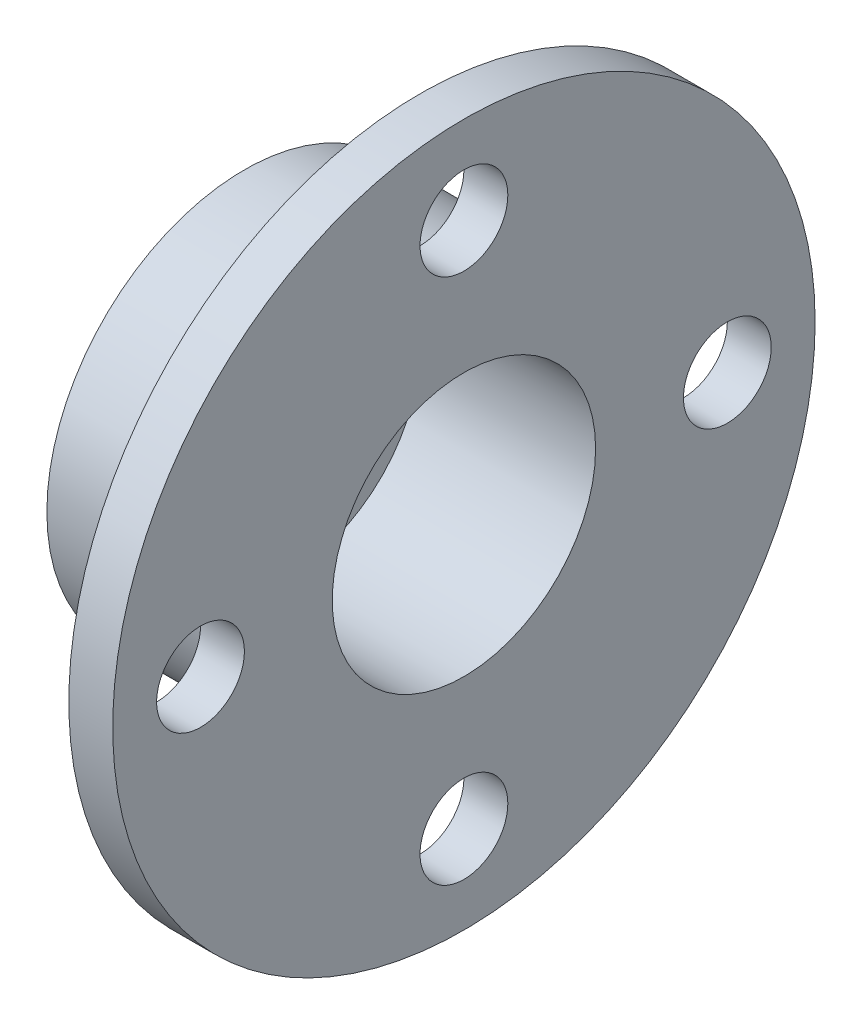
ISO-10303-21;
HEADER;
FILE_DESCRIPTION(('STEP AP214'),'2;1');
FILE_NAME('part.step','',(''),(''),'','','');
FILE_SCHEMA(('AUTOMOTIVE_DESIGN { 1 0 10303 214 1 1 1 1 }'));
ENDSEC;
DATA;
#1=APPLICATION_CONTEXT('core data for automotive mechanical design processes');
#2=APPLICATION_PROTOCOL_DEFINITION('international standard','automotive_design',2000,#1);
#3=PRODUCT_CONTEXT('',#1,'mechanical');
#4=PRODUCT('Part','Part','',(#3));
#5=PRODUCT_RELATED_PRODUCT_CATEGORY('part','',(#4));
#6=PRODUCT_DEFINITION_FORMATION('','',#4);
#7=PRODUCT_DEFINITION_CONTEXT('part definition',#1,'design');
#8=PRODUCT_DEFINITION('design','',#6,#7);
#9=PRODUCT_DEFINITION_SHAPE('','',#8);
#10=(LENGTH_UNIT() NAMED_UNIT(*) SI_UNIT(.MILLI.,.METRE.));
#11=(NAMED_UNIT(*) PLANE_ANGLE_UNIT() SI_UNIT($,.RADIAN.));
#12=(NAMED_UNIT(*) SI_UNIT($,.STERADIAN.) SOLID_ANGLE_UNIT());
#13=UNCERTAINTY_MEASURE_WITH_UNIT(LENGTH_MEASURE(1.E-05),#10,'distance_accuracy_value','');
#14=(GEOMETRIC_REPRESENTATION_CONTEXT(3) GLOBAL_UNCERTAINTY_ASSIGNED_CONTEXT((#13)) GLOBAL_UNIT_ASSIGNED_CONTEXT((#10,
#11,#12)) REPRESENTATION_CONTEXT('',''));
#15=CARTESIAN_POINT('',(0.,0.,0.));
#16=DIRECTION('',(0.,0.,1.));
#17=DIRECTION('',(1.,0.,0.));
#18=AXIS2_PLACEMENT_3D('',#15,#16,#17);
#19=CARTESIAN_POINT('',(-24.1275529865125,203.2,0.));
#20=DIRECTION('',(1.,0.,0.));
#21=DIRECTION('',(0.,0.,-1.));
#22=AXIS2_PLACEMENT_3D('',#19,#20,#21);
#23=PLANE('',#22);
#24=CARTESIAN_POINT('',(-24.1275529865125,152.4,0.));
#25=DIRECTION('',(1.,0.,0.));
#26=DIRECTION('',(0.,0.,-1.));
#27=AXIS2_PLACEMENT_3D('',#24,#25,#26);
#28=CIRCLE('',#27,25.4);
#29=CARTESIAN_POINT('',(-24.1275529865125,152.4,-25.4));
#30=VERTEX_POINT('',#29);
#31=EDGE_CURVE('E51',#30,#30,#28,.T.);
#32=ORIENTED_EDGE('',*,*,#31,.F.);
#33=EDGE_LOOP('',(#32));
#34=FACE_BOUND('',#33,.T.);
#35=CARTESIAN_POINT('',(-24.1275529865125,0.,-152.4));
#36=DIRECTION('',(1.,0.,0.));
#37=DIRECTION('',(0.,0.,-1.));
#38=AXIS2_PLACEMENT_3D('',#35,#36,#37);
#39=CIRCLE('',#38,25.4);
#40=CARTESIAN_POINT('',(-24.1275529865125,0.,-177.8));
#41=VERTEX_POINT('',#40);
#42=EDGE_CURVE('E107',#41,#41,#39,.T.);
#43=ORIENTED_EDGE('',*,*,#42,.F.);
#44=EDGE_LOOP('',(#43));
#45=FACE_BOUND('',#44,.T.);
#46=CARTESIAN_POINT('',(-24.1275529865125,-152.4,0.));
#47=DIRECTION('',(1.,0.,0.));
#48=DIRECTION('',(0.,0.,-1.));
#49=AXIS2_PLACEMENT_3D('',#46,#47,#48);
#50=CIRCLE('',#49,25.4);
#51=CARTESIAN_POINT('',(-24.1275529865125,-152.4,-25.4));
#52=VERTEX_POINT('',#51);
#53=EDGE_CURVE('E111',#52,#52,#50,.T.);
#54=ORIENTED_EDGE('',*,*,#53,.F.);
#55=EDGE_LOOP('',(#54));
#56=FACE_BOUND('',#55,.T.);
#57=CARTESIAN_POINT('',(-24.1275529865125,0.,152.4));
#58=DIRECTION('',(1.,0.,0.));
#59=DIRECTION('',(0.,0.,-1.));
#60=AXIS2_PLACEMENT_3D('',#57,#58,#59);
#61=CIRCLE('',#60,25.4);
#62=CARTESIAN_POINT('',(-24.1275529865125,0.,127.));
#63=VERTEX_POINT('',#62);
#64=EDGE_CURVE('E70',#63,#63,#61,.T.);
#65=ORIENTED_EDGE('',*,*,#64,.F.);
#66=EDGE_LOOP('',(#65));
#67=FACE_BOUND('',#66,.T.);
#68=CARTESIAN_POINT('',(-24.1275529865125,0.,0.));
#69=DIRECTION('',(1.,0.,0.));
#70=DIRECTION('',(0.,0.,-1.));
#71=AXIS2_PLACEMENT_3D('',#68,#69,#70);
#72=CIRCLE('',#71,203.2);
#73=CARTESIAN_POINT('',(-24.1275529865125,0.,-203.2));
#74=VERTEX_POINT('',#73);
#75=EDGE_CURVE('E58',#74,#74,#72,.T.);
#76=ORIENTED_EDGE('',*,*,#75,.T.);
#77=EDGE_LOOP('',(#76));
#78=FACE_BOUND('',#77,.T.);
#79=CARTESIAN_POINT('',(-24.1275529865125,0.,0.));
#80=DIRECTION('',(1.,0.,0.));
#81=DIRECTION('',(0.,0.,-1.));
#82=AXIS2_PLACEMENT_3D('',#79,#80,#81);
#83=CIRCLE('',#82,76.2);
#84=CARTESIAN_POINT('',(-24.1275529865125,0.,-76.2));
#85=VERTEX_POINT('',#84);
#86=EDGE_CURVE('E10',#85,#85,#83,.T.);
#87=ORIENTED_EDGE('',*,*,#86,.F.);
#88=EDGE_LOOP('',(#87));
#89=FACE_BOUND('',#88,.T.);
#90=ADVANCED_FACE('F31',(#34,#45,#56,#67,#78,#89),#23,.T.);
#91=CARTESIAN_POINT('',(0.,0.,0.));
#92=DIRECTION('',(1.,0.,0.));
#93=DIRECTION('',(0.,0.,-1.));
#94=AXIS2_PLACEMENT_3D('',#91,#92,#93);
#95=CYLINDRICAL_SURFACE('',#94,76.2);
#96=ORIENTED_EDGE('',*,*,#86,.T.);
#97=EDGE_LOOP('',(#96));
#98=FACE_BOUND('',#97,.T.);
#99=CARTESIAN_POINT('',(-125.727552986512,0.,0.));
#100=DIRECTION('',(1.,0.,0.));
#101=DIRECTION('',(0.,0.,-1.));
#102=AXIS2_PLACEMENT_3D('',#99,#100,#101);
#103=CIRCLE('',#102,76.1999999999999);
#104=CARTESIAN_POINT('',(-125.727552986512,0.,-76.1999999999999));
#105=VERTEX_POINT('',#104);
#106=EDGE_CURVE('E38',#105,#105,#103,.T.);
#107=ORIENTED_EDGE('',*,*,#106,.F.);
#108=EDGE_LOOP('',(#107));
#109=FACE_BOUND('',#108,.T.);
#110=ADVANCED_FACE('F88',(#98,#109),#95,.F.);
#111=CARTESIAN_POINT('',(-125.727552986512,76.1999999999999,0.));
#112=DIRECTION('',(1.,0.,0.));
#113=DIRECTION('',(0.,0.,-1.));
#114=AXIS2_PLACEMENT_3D('',#111,#112,#113);
#115=PLANE('',#114);
#116=ORIENTED_EDGE('',*,*,#106,.T.);
#117=EDGE_LOOP('',(#116));
#118=FACE_BOUND('',#117,.T.);
#119=CARTESIAN_POINT('',(-125.727552986512,0.,0.));
#120=DIRECTION('',(1.,0.,0.));
#121=DIRECTION('',(0.,0.,-1.));
#122=AXIS2_PLACEMENT_3D('',#119,#120,#121);
#123=CIRCLE('',#122,50.7999999999999);
#124=CARTESIAN_POINT('',(-125.727552986512,0.,-50.7999999999999));
#125=VERTEX_POINT('',#124);
#126=EDGE_CURVE('E43',#125,#125,#123,.T.);
#127=ORIENTED_EDGE('',*,*,#126,.F.);
#128=EDGE_LOOP('',(#127));
#129=FACE_BOUND('',#128,.T.);
#130=ADVANCED_FACE('F86',(#118,#129),#115,.T.);
#131=CARTESIAN_POINT('',(0.,0.,0.));
#132=DIRECTION('',(1.,0.,0.));
#133=DIRECTION('',(0.,0.,-1.));
#134=AXIS2_PLACEMENT_3D('',#131,#132,#133);
#135=CYLINDRICAL_SURFACE('',#134,50.7999999999999);
#136=ORIENTED_EDGE('',*,*,#126,.T.);
#137=EDGE_LOOP('',(#136));
#138=FACE_BOUND('',#137,.T.);
#139=CARTESIAN_POINT('',(-151.127552986512,0.,0.));
#140=DIRECTION('',(1.,0.,0.));
#141=DIRECTION('',(0.,0.,-1.));
#142=AXIS2_PLACEMENT_3D('',#139,#140,#141);
#143=CIRCLE('',#142,50.7999999999999);
#144=CARTESIAN_POINT('',(-151.127552986512,0.,-50.7999999999999));
#145=VERTEX_POINT('',#144);
#146=EDGE_CURVE('E78',#145,#145,#143,.T.);
#147=ORIENTED_EDGE('',*,*,#146,.F.);
#148=EDGE_LOOP('',(#147));
#149=FACE_BOUND('',#148,.T.);
#150=ADVANCED_FACE('F83',(#138,#149),#135,.F.);
#151=CARTESIAN_POINT('',(-151.127552986512,114.3,0.));
#152=DIRECTION('',(-1.,0.,0.));
#153=DIRECTION('',(0.,0.,1.));
#154=AXIS2_PLACEMENT_3D('',#151,#152,#153);
#155=PLANE('',#154);
#156=ORIENTED_EDGE('',*,*,#146,.T.);
#157=EDGE_LOOP('',(#156));
#158=FACE_BOUND('',#157,.T.);
#159=CARTESIAN_POINT('',(-151.127552986512,0.,0.));
#160=DIRECTION('',(1.,0.,0.));
#161=DIRECTION('',(0.,0.,-1.));
#162=AXIS2_PLACEMENT_3D('',#159,#160,#161);
#163=CIRCLE('',#162,114.3);
#164=CARTESIAN_POINT('',(-151.127552986512,0.,-114.3));
#165=VERTEX_POINT('',#164);
#166=EDGE_CURVE('E75',#165,#165,#163,.T.);
#167=ORIENTED_EDGE('',*,*,#166,.F.);
#168=EDGE_LOOP('',(#167));
#169=FACE_BOUND('',#168,.T.);
#170=ADVANCED_FACE('F95',(#158,#169),#155,.T.);
#171=CARTESIAN_POINT('',(0.,0.,0.));
#172=DIRECTION('',(1.,0.,0.));
#173=DIRECTION('',(0.,0.,-1.));
#174=AXIS2_PLACEMENT_3D('',#171,#172,#173);
#175=CYLINDRICAL_SURFACE('',#174,114.3);
#176=ORIENTED_EDGE('',*,*,#166,.T.);
#177=EDGE_LOOP('',(#176));
#178=FACE_BOUND('',#177,.T.);
#179=CARTESIAN_POINT('',(-49.5275529865125,0.,0.));
#180=DIRECTION('',(1.,0.,0.));
#181=DIRECTION('',(0.,0.,-1.));
#182=AXIS2_PLACEMENT_3D('',#179,#180,#181);
#183=CIRCLE('',#182,114.3);
#184=CARTESIAN_POINT('',(-49.5275529865125,0.,-114.3));
#185=VERTEX_POINT('',#184);
#186=EDGE_CURVE('E67',#185,#185,#183,.T.);
#187=ORIENTED_EDGE('',*,*,#186,.F.);
#188=EDGE_LOOP('',(#187));
#189=FACE_BOUND('',#188,.T.);
#190=ADVANCED_FACE('F144',(#178,#189),#175,.T.);
#191=CARTESIAN_POINT('',(-49.5275529865125,203.2,0.));
#192=DIRECTION('',(-1.,0.,0.));
#193=DIRECTION('',(0.,0.,1.));
#194=AXIS2_PLACEMENT_3D('',#191,#192,#193);
#195=PLANE('',#194);
#196=CARTESIAN_POINT('',(-49.5275529865125,152.4,0.));
#197=DIRECTION('',(-1.,0.,0.));
#198=DIRECTION('',(0.,0.,1.));
#199=AXIS2_PLACEMENT_3D('',#196,#197,#198);
#200=CIRCLE('',#199,25.4);
#201=CARTESIAN_POINT('',(-49.5275529865125,152.4,25.4));
#202=VERTEX_POINT('',#201);
#203=EDGE_CURVE('E34',#202,#202,#200,.T.);
#204=ORIENTED_EDGE('',*,*,#203,.F.);
#205=EDGE_LOOP('',(#204));
#206=FACE_BOUND('',#205,.T.);
#207=CARTESIAN_POINT('',(-49.5275529865125,0.,-152.4));
#208=DIRECTION('',(-1.,0.,0.));
#209=DIRECTION('',(0.,0.,1.));
#210=AXIS2_PLACEMENT_3D('',#207,#208,#209);
#211=CIRCLE('',#210,25.4);
#212=CARTESIAN_POINT('',(-49.5275529865125,0.,-127.));
#213=VERTEX_POINT('',#212);
#214=EDGE_CURVE('E53',#213,#213,#211,.T.);
#215=ORIENTED_EDGE('',*,*,#214,.F.);
#216=EDGE_LOOP('',(#215));
#217=FACE_BOUND('',#216,.T.);
#218=CARTESIAN_POINT('',(-49.5275529865125,-152.4,0.));
#219=DIRECTION('',(-1.,0.,0.));
#220=DIRECTION('',(0.,0.,1.));
#221=AXIS2_PLACEMENT_3D('',#218,#219,#220);
#222=CIRCLE('',#221,25.4);
#223=CARTESIAN_POINT('',(-49.5275529865125,-152.4,25.4));
#224=VERTEX_POINT('',#223);
#225=EDGE_CURVE('E50',#224,#224,#222,.T.);
#226=ORIENTED_EDGE('',*,*,#225,.F.);
#227=EDGE_LOOP('',(#226));
#228=FACE_BOUND('',#227,.T.);
#229=CARTESIAN_POINT('',(-49.5275529865125,0.,152.4));
#230=DIRECTION('',(-1.,0.,0.));
#231=DIRECTION('',(0.,0.,1.));
#232=AXIS2_PLACEMENT_3D('',#229,#230,#231);
#233=CIRCLE('',#232,25.4);
#234=CARTESIAN_POINT('',(-49.5275529865125,0.,177.8));
#235=VERTEX_POINT('',#234);
#236=EDGE_CURVE('E47',#235,#235,#233,.T.);
#237=ORIENTED_EDGE('',*,*,#236,.F.);
#238=EDGE_LOOP('',(#237));
#239=FACE_BOUND('',#238,.T.);
#240=ORIENTED_EDGE('',*,*,#186,.T.);
#241=EDGE_LOOP('',(#240));
#242=FACE_BOUND('',#241,.T.);
#243=CARTESIAN_POINT('',(-49.5275529865125,0.,0.));
#244=DIRECTION('',(1.,0.,0.));
#245=DIRECTION('',(0.,0.,-1.));
#246=AXIS2_PLACEMENT_3D('',#243,#244,#245);
#247=CIRCLE('',#246,203.2);
#248=CARTESIAN_POINT('',(-49.5275529865125,0.,-203.2));
#249=VERTEX_POINT('',#248);
#250=EDGE_CURVE('E62',#249,#249,#247,.T.);
#251=ORIENTED_EDGE('',*,*,#250,.F.);
#252=EDGE_LOOP('',(#251));
#253=FACE_BOUND('',#252,.T.);
#254=ADVANCED_FACE('F140',(#206,#217,#228,#239,#242,#253),#195,.T.);
#255=CARTESIAN_POINT('',(0.,0.,0.));
#256=DIRECTION('',(1.,0.,0.));
#257=DIRECTION('',(0.,0.,-1.));
#258=AXIS2_PLACEMENT_3D('',#255,#256,#257);
#259=CYLINDRICAL_SURFACE('',#258,203.2);
#260=ORIENTED_EDGE('',*,*,#250,.T.);
#261=EDGE_LOOP('',(#260));
#262=FACE_BOUND('',#261,.T.);
#263=ORIENTED_EDGE('',*,*,#75,.F.);
#264=EDGE_LOOP('',(#263));
#265=FACE_BOUND('',#264,.T.);
#266=ADVANCED_FACE('F136',(#262,#265),#259,.T.);
#267=CARTESIAN_POINT('',(-151.127552986512,0.,152.4));
#268=DIRECTION('',(1.,0.,0.));
#269=DIRECTION('',(0.,0.,-1.));
#270=AXIS2_PLACEMENT_3D('',#267,#268,#269);
#271=CYLINDRICAL_SURFACE('',#270,25.4);
#272=ORIENTED_EDGE('',*,*,#236,.T.);
#273=EDGE_LOOP('',(#272));
#274=FACE_BOUND('',#273,.T.);
#275=ORIENTED_EDGE('',*,*,#64,.T.);
#276=EDGE_LOOP('',(#275));
#277=FACE_BOUND('',#276,.T.);
#278=ADVANCED_FACE('F132',(#274,#277),#271,.F.);
#279=CARTESIAN_POINT('',(-151.127552986512,-152.4,0.));
#280=DIRECTION('',(1.,0.,0.));
#281=DIRECTION('',(0.,0.,-1.));
#282=AXIS2_PLACEMENT_3D('',#279,#280,#281);
#283=CYLINDRICAL_SURFACE('',#282,25.4);
#284=ORIENTED_EDGE('',*,*,#225,.T.);
#285=EDGE_LOOP('',(#284));
#286=FACE_BOUND('',#285,.T.);
#287=ORIENTED_EDGE('',*,*,#53,.T.);
#288=EDGE_LOOP('',(#287));
#289=FACE_BOUND('',#288,.T.);
#290=ADVANCED_FACE('F127',(#286,#289),#283,.F.);
#291=CARTESIAN_POINT('',(-151.127552986512,0.,-152.4));
#292=DIRECTION('',(1.,0.,0.));
#293=DIRECTION('',(0.,0.,-1.));
#294=AXIS2_PLACEMENT_3D('',#291,#292,#293);
#295=CYLINDRICAL_SURFACE('',#294,25.4);
#296=ORIENTED_EDGE('',*,*,#214,.T.);
#297=EDGE_LOOP('',(#296));
#298=FACE_BOUND('',#297,.T.);
#299=ORIENTED_EDGE('',*,*,#42,.T.);
#300=EDGE_LOOP('',(#299));
#301=FACE_BOUND('',#300,.T.);
#302=ADVANCED_FACE('F122',(#298,#301),#295,.F.);
#303=CARTESIAN_POINT('',(-151.127552986512,152.4,0.));
#304=DIRECTION('',(1.,0.,0.));
#305=DIRECTION('',(0.,0.,-1.));
#306=AXIS2_PLACEMENT_3D('',#303,#304,#305);
#307=CYLINDRICAL_SURFACE('',#306,25.4);
#308=ORIENTED_EDGE('',*,*,#203,.T.);
#309=EDGE_LOOP('',(#308));
#310=FACE_BOUND('',#309,.T.);
#311=ORIENTED_EDGE('',*,*,#31,.T.);
#312=EDGE_LOOP('',(#311));
#313=FACE_BOUND('',#312,.T.);
#314=ADVANCED_FACE('F120',(#310,#313),#307,.F.);
#315=CLOSED_SHELL('',(#90,#110,#130,#150,#170,#190,#254,#266,#278,#290,#302,#314));
#316=MANIFOLD_SOLID_BREP('B2',#315);
#317=ADVANCED_BREP_SHAPE_REPRESENTATION('',(#18,#316),#14);
#318=SHAPE_DEFINITION_REPRESENTATION(#9,#317);
ENDSEC;
END-ISO-10303-21;
